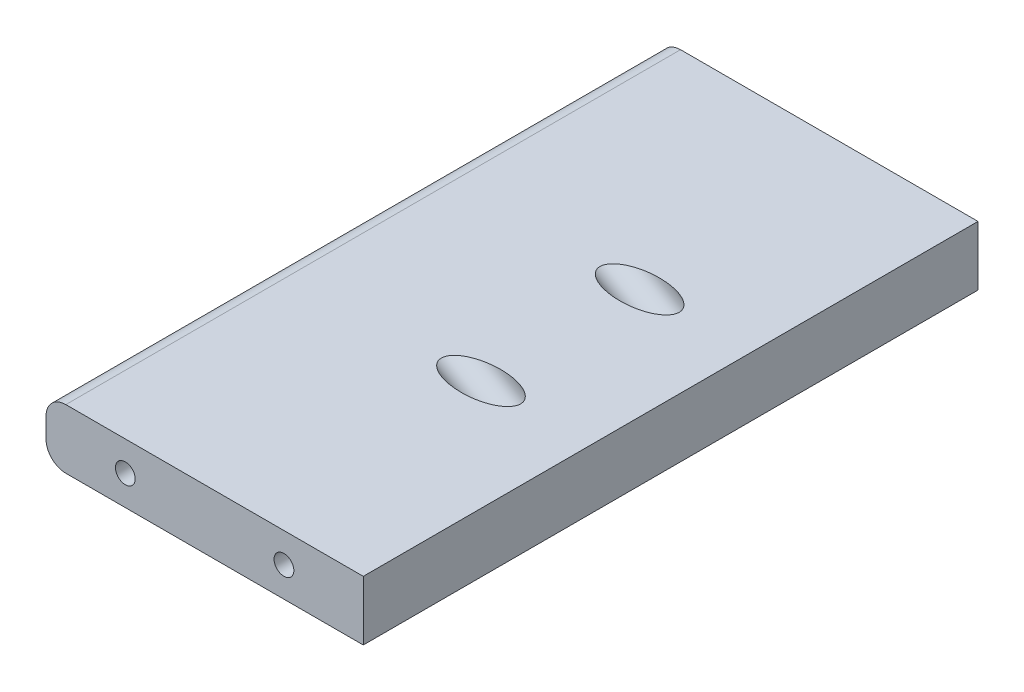
ISO-10303-21;
HEADER;
FILE_DESCRIPTION(('STEP AP214'),'2;1');
FILE_NAME('part.step','',(''),(''),'','','');
FILE_SCHEMA(('AUTOMOTIVE_DESIGN { 1 0 10303 214 1 1 1 1 }'));
ENDSEC;
DATA;
#1=APPLICATION_CONTEXT('core data for automotive mechanical design processes');
#2=APPLICATION_PROTOCOL_DEFINITION('international standard','automotive_design',2000,#1);
#3=PRODUCT_CONTEXT('',#1,'mechanical');
#4=PRODUCT('Part','Part','',(#3));
#5=PRODUCT_RELATED_PRODUCT_CATEGORY('part','',(#4));
#6=PRODUCT_DEFINITION_FORMATION('','',#4);
#7=PRODUCT_DEFINITION_CONTEXT('part definition',#1,'design');
#8=PRODUCT_DEFINITION('design','',#6,#7);
#9=PRODUCT_DEFINITION_SHAPE('','',#8);
#10=(LENGTH_UNIT() NAMED_UNIT(*) SI_UNIT(.MILLI.,.METRE.));
#11=(NAMED_UNIT(*) PLANE_ANGLE_UNIT() SI_UNIT($,.RADIAN.));
#12=(NAMED_UNIT(*) SI_UNIT($,.STERADIAN.) SOLID_ANGLE_UNIT());
#13=UNCERTAINTY_MEASURE_WITH_UNIT(LENGTH_MEASURE(1.E-05),#10,'distance_accuracy_value','');
#14=(GEOMETRIC_REPRESENTATION_CONTEXT(3) GLOBAL_UNCERTAINTY_ASSIGNED_CONTEXT((#13)) GLOBAL_UNIT_ASSIGNED_CONTEXT((#10,
#11,#12)) REPRESENTATION_CONTEXT('',''));
#15=CARTESIAN_POINT('',(0.,0.,0.));
#16=DIRECTION('',(0.,0.,1.));
#17=DIRECTION('',(1.,0.,0.));
#18=AXIS2_PLACEMENT_3D('',#15,#16,#17);
#19=CARTESIAN_POINT('',(-44.45,9.525,98.425));
#20=DIRECTION('',(0.,-1.,0.));
#21=DIRECTION('',(0.,0.,-1.));
#22=AXIS2_PLACEMENT_3D('',#19,#20,#21);
#23=PLANE('',#22);
#24=CARTESIAN_POINT('',(15.4667254442995,9.525,25.4000000000001));
#25=DIRECTION('',(0.,-1.,0.));
#26=DIRECTION('',(-1.,0.,0.));
#27=AXIS2_PLACEMENT_3D('',#24,#25,#26);
#28=ELLIPSE('',#27,12.7,6.35);
#29=CARTESIAN_POINT('',(2.76672544429957,9.525,25.4000000000001));
#30=VERTEX_POINT('',#29);
#31=EDGE_CURVE('E36',#30,#30,#28,.F.);
#32=ORIENTED_EDGE('',*,*,#31,.F.);
#33=EDGE_LOOP('',(#32));
#34=FACE_BOUND('',#33,.T.);
#35=CARTESIAN_POINT('',(15.4667254442996,9.525,-25.4));
#36=DIRECTION('',(0.,-1.,0.));
#37=DIRECTION('',(-1.,0.,0.));
#38=AXIS2_PLACEMENT_3D('',#35,#36,#37);
#39=ELLIPSE('',#38,12.7,6.35);
#40=CARTESIAN_POINT('',(2.76672544429959,9.525,-25.4));
#41=VERTEX_POINT('',#40);
#42=EDGE_CURVE('E136',#41,#41,#39,.F.);
#43=ORIENTED_EDGE('',*,*,#42,.F.);
#44=EDGE_LOOP('',(#43));
#45=FACE_BOUND('',#44,.T.);
#46=DIRECTION('',(-1.,0.,0.));
#47=VECTOR('',#46,1.);
#48=CARTESIAN_POINT('',(-44.45,9.525,-98.425));
#49=LINE('',#48,#47);
#50=CARTESIAN_POINT('',(50.8,9.525,-98.425));
#51=VERTEX_POINT('',#50);
#52=CARTESIAN_POINT('',(-44.45,9.525,-98.425));
#53=VERTEX_POINT('',#52);
#54=EDGE_CURVE('E120',#51,#53,#49,.T.);
#55=ORIENTED_EDGE('',*,*,#54,.T.);
#56=DIRECTION('',(0.,0.,-1.));
#57=VECTOR('',#56,1.);
#58=CARTESIAN_POINT('',(-44.45,9.525,98.425));
#59=LINE('',#58,#57);
#60=CARTESIAN_POINT('',(-44.45,9.525,98.425));
#61=VERTEX_POINT('',#60);
#62=EDGE_CURVE('E42',#61,#53,#59,.T.);
#63=ORIENTED_EDGE('',*,*,#62,.F.);
#64=DIRECTION('',(-1.,0.,0.));
#65=VECTOR('',#64,1.);
#66=CARTESIAN_POINT('',(44.45,9.525,98.425));
#67=LINE('',#66,#65);
#68=CARTESIAN_POINT('',(50.8,9.525,98.425));
#69=VERTEX_POINT('',#68);
#70=EDGE_CURVE('E85',#69,#61,#67,.T.);
#71=ORIENTED_EDGE('',*,*,#70,.F.);
#72=DIRECTION('',(0.,0.,-1.));
#73=VECTOR('',#72,1.);
#74=CARTESIAN_POINT('',(50.8,9.525,98.425));
#75=LINE('',#74,#73);
#76=EDGE_CURVE('E11',#69,#51,#75,.T.);
#77=ORIENTED_EDGE('',*,*,#76,.T.);
#78=EDGE_LOOP('',(#55,#63,#71,#77));
#79=FACE_BOUND('',#78,.T.);
#80=ADVANCED_FACE('F33',(#34,#45,#79),#23,.F.);
#81=CARTESIAN_POINT('',(-44.45,3.175,98.425));
#82=DIRECTION('',(0.,0.,-1.));
#83=DIRECTION('',(-1.,0.,0.));
#84=AXIS2_PLACEMENT_3D('',#81,#82,#83);
#85=CYLINDRICAL_SURFACE('',#84,6.35);
#86=CARTESIAN_POINT('',(-44.45,3.175,-98.425));
#87=DIRECTION('',(0.,0.,1.));
#88=DIRECTION('',(1.,0.,0.));
#89=AXIS2_PLACEMENT_3D('',#86,#87,#88);
#90=CIRCLE('',#89,6.35);
#91=CARTESIAN_POINT('',(-50.8,3.17499999999996,-98.425));
#92=VERTEX_POINT('',#91);
#93=EDGE_CURVE('E122',#53,#92,#90,.T.);
#94=ORIENTED_EDGE('',*,*,#93,.T.);
#95=DIRECTION('',(0.,0.,-1.));
#96=VECTOR('',#95,1.);
#97=CARTESIAN_POINT('',(-50.8,3.17499999999996,98.425));
#98=LINE('',#97,#96);
#99=CARTESIAN_POINT('',(-50.8,3.17499999999996,98.425));
#100=VERTEX_POINT('',#99);
#101=EDGE_CURVE('E110',#100,#92,#98,.T.);
#102=ORIENTED_EDGE('',*,*,#101,.F.);
#103=CARTESIAN_POINT('',(-44.45,3.175,98.425));
#104=DIRECTION('',(0.,0.,1.));
#105=DIRECTION('',(1.,0.,0.));
#106=AXIS2_PLACEMENT_3D('',#103,#104,#105);
#107=CIRCLE('',#106,6.35);
#108=EDGE_CURVE('E99',#61,#100,#107,.T.);
#109=ORIENTED_EDGE('',*,*,#108,.F.);
#110=ORIENTED_EDGE('',*,*,#62,.T.);
#111=EDGE_LOOP('',(#94,#102,#109,#110));
#112=FACE_BOUND('',#111,.T.);
#113=ADVANCED_FACE('F169',(#112),#85,.T.);
#114=CARTESIAN_POINT('',(-50.8,-3.17499999999996,98.425));
#115=DIRECTION('',(1.,0.,0.));
#116=DIRECTION('',(0.,0.,-1.));
#117=AXIS2_PLACEMENT_3D('',#114,#115,#116);
#118=PLANE('',#117);
#119=DIRECTION('',(0.,-1.,0.));
#120=VECTOR('',#119,1.);
#121=CARTESIAN_POINT('',(-50.8,-3.17499999999996,-98.425));
#122=LINE('',#121,#120);
#123=CARTESIAN_POINT('',(-50.8,-3.17499999999996,-98.425));
#124=VERTEX_POINT('',#123);
#125=EDGE_CURVE('E108',#92,#124,#122,.T.);
#126=ORIENTED_EDGE('',*,*,#125,.T.);
#127=DIRECTION('',(0.,0.,-1.));
#128=VECTOR('',#127,1.);
#129=CARTESIAN_POINT('',(-50.8,-3.17499999999996,98.425));
#130=LINE('',#129,#128);
#131=CARTESIAN_POINT('',(-50.8,-3.17499999999996,98.425));
#132=VERTEX_POINT('',#131);
#133=EDGE_CURVE('E105',#132,#124,#130,.T.);
#134=ORIENTED_EDGE('',*,*,#133,.F.);
#135=DIRECTION('',(0.,-1.,0.));
#136=VECTOR('',#135,1.);
#137=CARTESIAN_POINT('',(-50.8,-3.17499999999996,98.425));
#138=LINE('',#137,#136);
#139=EDGE_CURVE('E92',#100,#132,#138,.T.);
#140=ORIENTED_EDGE('',*,*,#139,.F.);
#141=ORIENTED_EDGE('',*,*,#101,.T.);
#142=EDGE_LOOP('',(#126,#134,#140,#141));
#143=FACE_BOUND('',#142,.T.);
#144=ADVANCED_FACE('F106',(#143),#118,.F.);
#145=CARTESIAN_POINT('',(-44.45,-3.175,98.425));
#146=DIRECTION('',(0.,0.,-1.));
#147=DIRECTION('',(-1.,0.,0.));
#148=AXIS2_PLACEMENT_3D('',#145,#146,#147);
#149=CYLINDRICAL_SURFACE('',#148,6.35);
#150=CARTESIAN_POINT('',(-44.45,-3.175,-98.425));
#151=DIRECTION('',(0.,0.,1.));
#152=DIRECTION('',(1.,0.,0.));
#153=AXIS2_PLACEMENT_3D('',#150,#151,#152);
#154=CIRCLE('',#153,6.35);
#155=CARTESIAN_POINT('',(-44.45,-9.525,-98.425));
#156=VERTEX_POINT('',#155);
#157=EDGE_CURVE('E126',#124,#156,#154,.T.);
#158=ORIENTED_EDGE('',*,*,#157,.T.);
#159=DIRECTION('',(0.,0.,-1.));
#160=VECTOR('',#159,1.);
#161=CARTESIAN_POINT('',(-44.45,-9.525,98.425));
#162=LINE('',#161,#160);
#163=CARTESIAN_POINT('',(-44.45,-9.525,98.425));
#164=VERTEX_POINT('',#163);
#165=EDGE_CURVE('E111',#164,#156,#162,.T.);
#166=ORIENTED_EDGE('',*,*,#165,.F.);
#167=CARTESIAN_POINT('',(-44.45,-3.175,98.425));
#168=DIRECTION('',(0.,0.,1.));
#169=DIRECTION('',(1.,0.,0.));
#170=AXIS2_PLACEMENT_3D('',#167,#168,#169);
#171=CIRCLE('',#170,6.35);
#172=EDGE_CURVE('E96',#132,#164,#171,.T.);
#173=ORIENTED_EDGE('',*,*,#172,.F.);
#174=ORIENTED_EDGE('',*,*,#133,.T.);
#175=EDGE_LOOP('',(#158,#166,#173,#174));
#176=FACE_BOUND('',#175,.T.);
#177=ADVANCED_FACE('F113',(#176),#149,.T.);
#178=CARTESIAN_POINT('',(44.45,-9.525,98.425));
#179=DIRECTION('',(0.,1.,0.));
#180=DIRECTION('',(0.,0.,1.));
#181=AXIS2_PLACEMENT_3D('',#178,#179,#180);
#182=PLANE('',#181);
#183=DIRECTION('',(1.,0.,0.));
#184=VECTOR('',#183,1.);
#185=CARTESIAN_POINT('',(44.45,-9.525,-98.425));
#186=LINE('',#185,#184);
#187=CARTESIAN_POINT('',(50.8,-9.525,-98.425));
#188=VERTEX_POINT('',#187);
#189=EDGE_CURVE('E74',#156,#188,#186,.T.);
#190=ORIENTED_EDGE('',*,*,#189,.T.);
#191=DIRECTION('',(0.,0.,-1.));
#192=VECTOR('',#191,1.);
#193=CARTESIAN_POINT('',(50.8,-9.525,98.425));
#194=LINE('',#193,#192);
#195=CARTESIAN_POINT('',(50.8,-9.525,98.425));
#196=VERTEX_POINT('',#195);
#197=EDGE_CURVE('E116',#196,#188,#194,.T.);
#198=ORIENTED_EDGE('',*,*,#197,.F.);
#199=DIRECTION('',(1.,0.,0.));
#200=VECTOR('',#199,1.);
#201=CARTESIAN_POINT('',(-44.45,-9.525,98.425));
#202=LINE('',#201,#200);
#203=EDGE_CURVE('E51',#164,#196,#202,.T.);
#204=ORIENTED_EDGE('',*,*,#203,.F.);
#205=ORIENTED_EDGE('',*,*,#165,.T.);
#206=EDGE_LOOP('',(#190,#198,#204,#205));
#207=FACE_BOUND('',#206,.T.);
#208=ADVANCED_FACE('F172',(#207),#182,.F.);
#209=CARTESIAN_POINT('',(50.8,-3.17499999999996,98.425));
#210=DIRECTION('',(-1.,0.,0.));
#211=DIRECTION('',(0.,0.,1.));
#212=AXIS2_PLACEMENT_3D('',#209,#210,#211);
#213=PLANE('',#212);
#214=DIRECTION('',(0.,1.,0.));
#215=VECTOR('',#214,1.);
#216=CARTESIAN_POINT('',(50.8,-3.17499999999996,-98.425));
#217=LINE('',#216,#215);
#218=EDGE_CURVE('E78',#188,#51,#217,.T.);
#219=ORIENTED_EDGE('',*,*,#218,.T.);
#220=ORIENTED_EDGE('',*,*,#76,.F.);
#221=DIRECTION('',(0.,1.,0.));
#222=VECTOR('',#221,1.);
#223=CARTESIAN_POINT('',(50.8,9.525,98.425));
#224=LINE('',#223,#222);
#225=EDGE_CURVE('E130',#196,#69,#224,.T.);
#226=ORIENTED_EDGE('',*,*,#225,.F.);
#227=ORIENTED_EDGE('',*,*,#197,.T.);
#228=EDGE_LOOP('',(#219,#220,#226,#227));
#229=FACE_BOUND('',#228,.T.);
#230=ADVANCED_FACE('F175',(#229),#213,.F.);
#231=CARTESIAN_POINT('',(-44.45,-3.175,98.425));
#232=DIRECTION('',(0.,0.,1.));
#233=DIRECTION('',(1.,0.,0.));
#234=AXIS2_PLACEMENT_3D('',#231,#232,#233);
#235=PLANE('',#234);
#236=CARTESIAN_POINT('',(-25.4,0.,98.425));
#237=DIRECTION('',(0.,0.,1.));
#238=DIRECTION('',(1.,0.,0.));
#239=AXIS2_PLACEMENT_3D('',#236,#237,#238);
#240=CIRCLE('',#239,3.175);
#241=CARTESIAN_POINT('',(-22.225,0.,98.425));
#242=VERTEX_POINT('',#241);
#243=EDGE_CURVE('E157',#242,#242,#240,.T.);
#244=ORIENTED_EDGE('',*,*,#243,.F.);
#245=EDGE_LOOP('',(#244));
#246=FACE_BOUND('',#245,.T.);
#247=CARTESIAN_POINT('',(25.4,0.,98.425));
#248=DIRECTION('',(0.,0.,1.));
#249=DIRECTION('',(1.,0.,0.));
#250=AXIS2_PLACEMENT_3D('',#247,#248,#249);
#251=CIRCLE('',#250,3.175);
#252=CARTESIAN_POINT('',(28.575,0.,98.425));
#253=VERTEX_POINT('',#252);
#254=EDGE_CURVE('E142',#253,#253,#251,.T.);
#255=ORIENTED_EDGE('',*,*,#254,.F.);
#256=EDGE_LOOP('',(#255));
#257=FACE_BOUND('',#256,.T.);
#258=ORIENTED_EDGE('',*,*,#225,.T.);
#259=ORIENTED_EDGE('',*,*,#70,.T.);
#260=ORIENTED_EDGE('',*,*,#108,.T.);
#261=ORIENTED_EDGE('',*,*,#139,.T.);
#262=ORIENTED_EDGE('',*,*,#172,.T.);
#263=ORIENTED_EDGE('',*,*,#203,.T.);
#264=EDGE_LOOP('',(#258,#259,#260,#261,#262,#263));
#265=FACE_BOUND('',#264,.T.);
#266=ADVANCED_FACE('F94',(#246,#257,#265),#235,.T.);
#267=CARTESIAN_POINT('',(-44.45,-3.175,-98.425));
#268=DIRECTION('',(0.,0.,1.));
#269=DIRECTION('',(1.,0.,0.));
#270=AXIS2_PLACEMENT_3D('',#267,#268,#269);
#271=PLANE('',#270);
#272=CARTESIAN_POINT('',(-25.4,0.,-98.425));
#273=DIRECTION('',(0.,0.,1.));
#274=DIRECTION('',(1.,0.,0.));
#275=AXIS2_PLACEMENT_3D('',#272,#273,#274);
#276=CIRCLE('',#275,3.175);
#277=CARTESIAN_POINT('',(-22.225,0.,-98.425));
#278=VERTEX_POINT('',#277);
#279=EDGE_CURVE('E240',#278,#278,#276,.T.);
#280=ORIENTED_EDGE('',*,*,#279,.T.);
#281=EDGE_LOOP('',(#280));
#282=FACE_BOUND('',#281,.T.);
#283=CARTESIAN_POINT('',(25.4,0.,-98.425));
#284=DIRECTION('',(0.,0.,1.));
#285=DIRECTION('',(1.,0.,0.));
#286=AXIS2_PLACEMENT_3D('',#283,#284,#285);
#287=CIRCLE('',#286,3.175);
#288=CARTESIAN_POINT('',(28.575,0.,-98.425));
#289=VERTEX_POINT('',#288);
#290=EDGE_CURVE('E152',#289,#289,#287,.T.);
#291=ORIENTED_EDGE('',*,*,#290,.T.);
#292=EDGE_LOOP('',(#291));
#293=FACE_BOUND('',#292,.T.);
#294=ORIENTED_EDGE('',*,*,#54,.F.);
#295=ORIENTED_EDGE('',*,*,#218,.F.);
#296=ORIENTED_EDGE('',*,*,#189,.F.);
#297=ORIENTED_EDGE('',*,*,#157,.F.);
#298=ORIENTED_EDGE('',*,*,#125,.F.);
#299=ORIENTED_EDGE('',*,*,#93,.F.);
#300=EDGE_LOOP('',(#294,#295,#296,#297,#298,#299));
#301=FACE_BOUND('',#300,.T.);
#302=ADVANCED_FACE('F170',(#282,#293,#301),#271,.F.);
#303=CARTESIAN_POINT('',(25.4,0.,85.725));
#304=DIRECTION('',(0.,0.,1.));
#305=DIRECTION('',(1.,0.,0.));
#306=AXIS2_PLACEMENT_3D('',#303,#304,#305);
#307=CYLINDRICAL_SURFACE('',#306,3.175);
#308=CARTESIAN_POINT('',(25.4,0.,85.725));
#309=DIRECTION('',(0.,0.,1.));
#310=DIRECTION('',(1.,0.,0.));
#311=AXIS2_PLACEMENT_3D('',#308,#309,#310);
#312=CIRCLE('',#311,3.175);
#313=CARTESIAN_POINT('',(28.575,0.,85.725));
#314=VERTEX_POINT('',#313);
#315=EDGE_CURVE('E160',#314,#314,#312,.T.);
#316=ORIENTED_EDGE('',*,*,#315,.F.);
#317=EDGE_LOOP('',(#316));
#318=FACE_BOUND('',#317,.T.);
#319=ORIENTED_EDGE('',*,*,#254,.T.);
#320=EDGE_LOOP('',(#319));
#321=FACE_BOUND('',#320,.T.);
#322=ADVANCED_FACE('F227',(#318,#321),#307,.F.);
#323=CARTESIAN_POINT('',(25.4,0.,85.725));
#324=DIRECTION('',(0.,0.,1.));
#325=DIRECTION('',(1.,0.,0.));
#326=AXIS2_PLACEMENT_3D('',#323,#324,#325);
#327=PLANE('',#326);
#328=ORIENTED_EDGE('',*,*,#315,.T.);
#329=EDGE_LOOP('',(#328));
#330=FACE_BOUND('',#329,.T.);
#331=ADVANCED_FACE('F223',(#330),#327,.T.);
#332=CARTESIAN_POINT('',(-25.4,0.,85.725));
#333=DIRECTION('',(0.,0.,1.));
#334=DIRECTION('',(1.,0.,0.));
#335=AXIS2_PLACEMENT_3D('',#332,#333,#334);
#336=CYLINDRICAL_SURFACE('',#335,3.175);
#337=CARTESIAN_POINT('',(-25.4,0.,85.725));
#338=DIRECTION('',(0.,0.,1.));
#339=DIRECTION('',(1.,0.,0.));
#340=AXIS2_PLACEMENT_3D('',#337,#338,#339);
#341=CIRCLE('',#340,3.175);
#342=CARTESIAN_POINT('',(-22.225,0.,85.725));
#343=VERTEX_POINT('',#342);
#344=EDGE_CURVE('E123',#343,#343,#341,.T.);
#345=ORIENTED_EDGE('',*,*,#344,.F.);
#346=EDGE_LOOP('',(#345));
#347=FACE_BOUND('',#346,.T.);
#348=ORIENTED_EDGE('',*,*,#243,.T.);
#349=EDGE_LOOP('',(#348));
#350=FACE_BOUND('',#349,.T.);
#351=ADVANCED_FACE('F219',(#347,#350),#336,.F.);
#352=CARTESIAN_POINT('',(-25.4,0.,85.725));
#353=DIRECTION('',(0.,0.,1.));
#354=DIRECTION('',(1.,0.,0.));
#355=AXIS2_PLACEMENT_3D('',#352,#353,#354);
#356=PLANE('',#355);
#357=ORIENTED_EDGE('',*,*,#344,.T.);
#358=EDGE_LOOP('',(#357));
#359=FACE_BOUND('',#358,.T.);
#360=ADVANCED_FACE('F215',(#359),#356,.T.);
#361=CARTESIAN_POINT('',(27.7214990269993,2.44970317317039,-25.4));
#362=DIRECTION('',(-0.866025403784438,0.500000000000001,0.));
#363=DIRECTION('',(-0.500000000000001,-0.866025403784438,0.));
#364=AXIS2_PLACEMENT_3D('',#361,#362,#363);
#365=CYLINDRICAL_SURFACE('',#364,6.35);
#366=CARTESIAN_POINT('',(27.7214990269993,2.44970317317039,-25.4));
#367=DIRECTION('',(0.866025403784438,-0.500000000000001,0.));
#368=DIRECTION('',(0.500000000000001,0.866025403784438,0.));
#369=AXIS2_PLACEMENT_3D('',#366,#367,#368);
#370=CIRCLE('',#369,6.35);
#371=CARTESIAN_POINT('',(30.8964990269993,7.94896448720158,-25.4));
#372=VERTEX_POINT('',#371);
#373=EDGE_CURVE('E144',#372,#372,#370,.T.);
#374=ORIENTED_EDGE('',*,*,#373,.T.);
#375=EDGE_LOOP('',(#374));
#376=FACE_BOUND('',#375,.T.);
#377=ORIENTED_EDGE('',*,*,#42,.T.);
#378=EDGE_LOOP('',(#377));
#379=FACE_BOUND('',#378,.T.);
#380=ADVANCED_FACE('F208',(#376,#379),#365,.F.);
#381=CARTESIAN_POINT('',(27.7214990269993,2.44970317317039,-25.4));
#382=DIRECTION('',(0.866025403784438,-0.500000000000001,0.));
#383=DIRECTION('',(0.500000000000001,0.866025403784438,0.));
#384=AXIS2_PLACEMENT_3D('',#381,#382,#383);
#385=PLANE('',#384);
#386=ORIENTED_EDGE('',*,*,#373,.F.);
#387=EDGE_LOOP('',(#386));
#388=FACE_BOUND('',#387,.T.);
#389=ADVANCED_FACE('F199',(#388),#385,.F.);
#390=CARTESIAN_POINT('',(27.7214990269993,2.44970317317038,25.4000000000001));
#391=DIRECTION('',(-0.866025403784438,0.500000000000001,0.));
#392=DIRECTION('',(-0.500000000000001,-0.866025403784438,0.));
#393=AXIS2_PLACEMENT_3D('',#390,#391,#392);
#394=CYLINDRICAL_SURFACE('',#393,6.35);
#395=CARTESIAN_POINT('',(27.7214990269993,2.44970317317038,25.4000000000001));
#396=DIRECTION('',(0.866025403784438,-0.500000000000001,0.));
#397=DIRECTION('',(0.500000000000001,0.866025403784438,0.));
#398=AXIS2_PLACEMENT_3D('',#395,#396,#397);
#399=CIRCLE('',#398,6.35);
#400=CARTESIAN_POINT('',(30.8964990269993,7.94896448720156,25.4000000000001));
#401=VERTEX_POINT('',#400);
#402=EDGE_CURVE('E138',#401,#401,#399,.T.);
#403=ORIENTED_EDGE('',*,*,#402,.T.);
#404=EDGE_LOOP('',(#403));
#405=FACE_BOUND('',#404,.T.);
#406=ORIENTED_EDGE('',*,*,#31,.T.);
#407=EDGE_LOOP('',(#406));
#408=FACE_BOUND('',#407,.T.);
#409=ADVANCED_FACE('F196',(#405,#408),#394,.F.);
#410=CARTESIAN_POINT('',(27.7214990269993,2.44970317317038,25.4000000000001));
#411=DIRECTION('',(0.866025403784438,-0.500000000000001,0.));
#412=DIRECTION('',(0.500000000000001,0.866025403784438,0.));
#413=AXIS2_PLACEMENT_3D('',#410,#411,#412);
#414=PLANE('',#413);
#415=ORIENTED_EDGE('',*,*,#402,.F.);
#416=EDGE_LOOP('',(#415));
#417=FACE_BOUND('',#416,.T.);
#418=ADVANCED_FACE('F198',(#417),#414,.F.);
#419=CARTESIAN_POINT('',(25.4,0.,-85.725));
#420=DIRECTION('',(0.,0.,-1.));
#421=DIRECTION('',(-1.,0.,0.));
#422=AXIS2_PLACEMENT_3D('',#419,#420,#421);
#423=CYLINDRICAL_SURFACE('',#422,3.175);
#424=CARTESIAN_POINT('',(25.4,0.,-85.725));
#425=DIRECTION('',(0.,0.,1.));
#426=DIRECTION('',(1.,0.,0.));
#427=AXIS2_PLACEMENT_3D('',#424,#425,#426);
#428=CIRCLE('',#427,3.175);
#429=CARTESIAN_POINT('',(28.575,0.,-85.725));
#430=VERTEX_POINT('',#429);
#431=EDGE_CURVE('E244',#430,#430,#428,.T.);
#432=ORIENTED_EDGE('',*,*,#431,.T.);
#433=EDGE_LOOP('',(#432));
#434=FACE_BOUND('',#433,.T.);
#435=ORIENTED_EDGE('',*,*,#290,.F.);
#436=EDGE_LOOP('',(#435));
#437=FACE_BOUND('',#436,.T.);
#438=ADVANCED_FACE('F205',(#434,#437),#423,.F.);
#439=CARTESIAN_POINT('',(25.4,0.,-85.725));
#440=DIRECTION('',(0.,0.,-1.));
#441=DIRECTION('',(1.,0.,0.));
#442=AXIS2_PLACEMENT_3D('',#439,#440,#441);
#443=PLANE('',#442);
#444=ORIENTED_EDGE('',*,*,#431,.F.);
#445=EDGE_LOOP('',(#444));
#446=FACE_BOUND('',#445,.T.);
#447=ADVANCED_FACE('F262',(#446),#443,.T.);
#448=CARTESIAN_POINT('',(-25.4,0.,-85.725));
#449=DIRECTION('',(0.,0.,-1.));
#450=DIRECTION('',(-1.,0.,0.));
#451=AXIS2_PLACEMENT_3D('',#448,#449,#450);
#452=CYLINDRICAL_SURFACE('',#451,3.175);
#453=CARTESIAN_POINT('',(-25.4,0.,-85.725));
#454=DIRECTION('',(0.,0.,1.));
#455=DIRECTION('',(1.,0.,0.));
#456=AXIS2_PLACEMENT_3D('',#453,#454,#455);
#457=CIRCLE('',#456,3.175);
#458=CARTESIAN_POINT('',(-22.225,0.,-85.725));
#459=VERTEX_POINT('',#458);
#460=EDGE_CURVE('E149',#459,#459,#457,.T.);
#461=ORIENTED_EDGE('',*,*,#460,.T.);
#462=EDGE_LOOP('',(#461));
#463=FACE_BOUND('',#462,.T.);
#464=ORIENTED_EDGE('',*,*,#279,.F.);
#465=EDGE_LOOP('',(#464));
#466=FACE_BOUND('',#465,.T.);
#467=ADVANCED_FACE('F253',(#463,#466),#452,.F.);
#468=CARTESIAN_POINT('',(-25.4,0.,-85.725));
#469=DIRECTION('',(0.,0.,-1.));
#470=DIRECTION('',(1.,0.,0.));
#471=AXIS2_PLACEMENT_3D('',#468,#469,#470);
#472=PLANE('',#471);
#473=ORIENTED_EDGE('',*,*,#460,.F.);
#474=EDGE_LOOP('',(#473));
#475=FACE_BOUND('',#474,.T.);
#476=ADVANCED_FACE('F256',(#475),#472,.T.);
#477=CLOSED_SHELL('',(#80,#113,#144,#177,#208,#230,#266,#302,#322,#331,#351,#360,#380,#389,#409,
#418,#438,#447,#467,#476));
#478=MANIFOLD_SOLID_BREP('B2',#477);
#479=ADVANCED_BREP_SHAPE_REPRESENTATION('',(#18,#478),#14);
#480=SHAPE_DEFINITION_REPRESENTATION(#9,#479);
ENDSEC;
END-ISO-10303-21;
